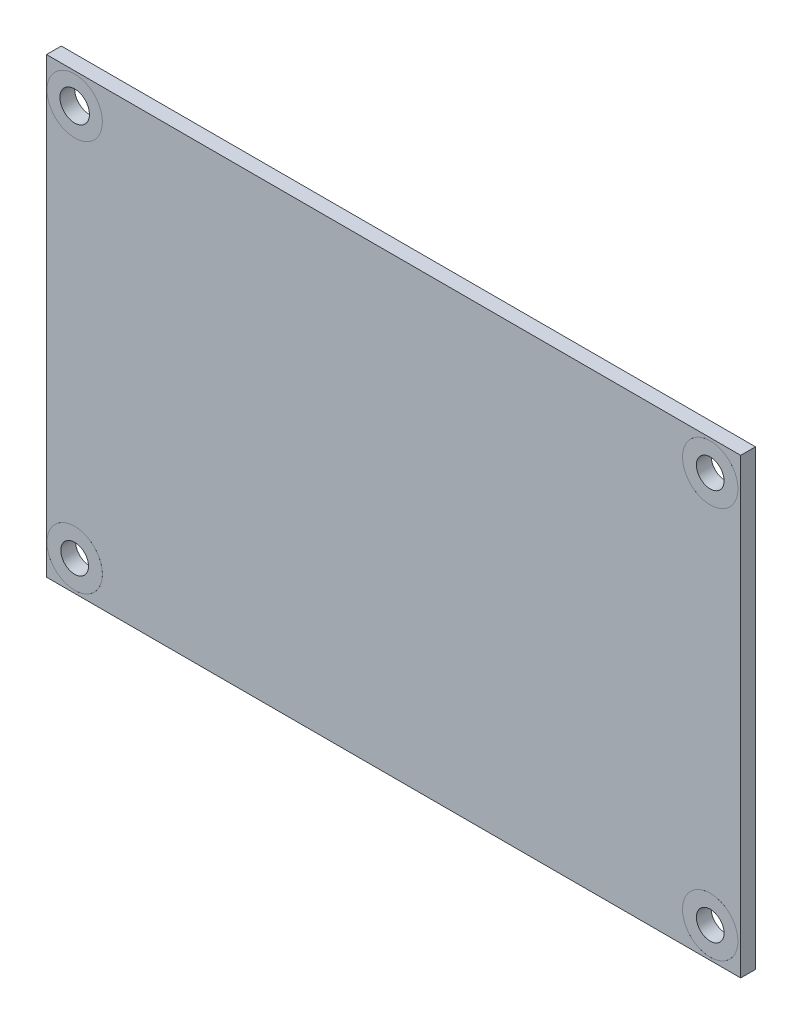
ISO-10303-21;
HEADER;
FILE_DESCRIPTION(('STEP AP214'),'2;1');
FILE_NAME('part.step','',(''),(''),'','','');
FILE_SCHEMA(('AUTOMOTIVE_DESIGN { 1 0 10303 214 1 1 1 1 }'));
ENDSEC;
DATA;
#1=APPLICATION_CONTEXT('core data for automotive mechanical design processes');
#2=APPLICATION_PROTOCOL_DEFINITION('international standard','automotive_design',2000,#1);
#3=PRODUCT_CONTEXT('',#1,'mechanical');
#4=PRODUCT('Part','Part','',(#3));
#5=PRODUCT_RELATED_PRODUCT_CATEGORY('part','',(#4));
#6=PRODUCT_DEFINITION_FORMATION('','',#4);
#7=PRODUCT_DEFINITION_CONTEXT('part definition',#1,'design');
#8=PRODUCT_DEFINITION('design','',#6,#7);
#9=PRODUCT_DEFINITION_SHAPE('','',#8);
#10=(LENGTH_UNIT() NAMED_UNIT(*) SI_UNIT(.MILLI.,.METRE.));
#11=(NAMED_UNIT(*) PLANE_ANGLE_UNIT() SI_UNIT($,.RADIAN.));
#12=(NAMED_UNIT(*) SI_UNIT($,.STERADIAN.) SOLID_ANGLE_UNIT());
#13=UNCERTAINTY_MEASURE_WITH_UNIT(LENGTH_MEASURE(1.E-05),#10,'distance_accuracy_value','');
#14=(GEOMETRIC_REPRESENTATION_CONTEXT(3) GLOBAL_UNCERTAINTY_ASSIGNED_CONTEXT((#13)) GLOBAL_UNIT_ASSIGNED_CONTEXT((#10,
#11,#12)) REPRESENTATION_CONTEXT('',''));
#15=CARTESIAN_POINT('',(0.,0.,0.));
#16=DIRECTION('',(0.,0.,1.));
#17=DIRECTION('',(1.,0.,0.));
#18=AXIS2_PLACEMENT_3D('',#15,#16,#17);
#19=CARTESIAN_POINT('',(-34.54,-21.21,10.0854813742386));
#20=DIRECTION('',(0.,0.,-1.));
#21=DIRECTION('',(-1.,0.,0.));
#22=AXIS2_PLACEMENT_3D('',#19,#20,#21);
#23=CYLINDRICAL_SURFACE('',#22,3.);
#24=CARTESIAN_POINT('',(-34.54,-21.21,0.));
#25=DIRECTION('',(0.,0.,-1.));
#26=DIRECTION('',(-1.,0.,0.));
#27=AXIS2_PLACEMENT_3D('',#24,#25,#26);
#28=CIRCLE('',#27,3.);
#29=CARTESIAN_POINT('',(-37.54,-21.21,0.));
#30=VERTEX_POINT('',#29);
#31=EDGE_CURVE('E47',#30,#30,#28,.T.);
#32=ORIENTED_EDGE('',*,*,#31,.F.);
#33=EDGE_LOOP('',(#32));
#34=FACE_BOUND('',#33,.T.);
#35=CARTESIAN_POINT('',(-34.54,-21.21,1.6002));
#36=DIRECTION('',(0.,0.,1.));
#37=DIRECTION('',(1.,0.,0.));
#38=AXIS2_PLACEMENT_3D('',#35,#36,#37);
#39=CIRCLE('',#38,3.);
#40=CARTESIAN_POINT('',(-31.54,-21.21,1.6002));
#41=VERTEX_POINT('',#40);
#42=EDGE_CURVE('E43',#41,#41,#39,.F.);
#43=ORIENTED_EDGE('',*,*,#42,.T.);
#44=EDGE_LOOP('',(#43));
#45=FACE_BOUND('',#44,.T.);
#46=ADVANCED_FACE('F39',(#34,#45),#23,.T.);
#47=CARTESIAN_POINT('',(-34.54,-21.21,10.0854813742386));
#48=DIRECTION('',(0.,0.,-1.));
#49=DIRECTION('',(-1.,0.,0.));
#50=AXIS2_PLACEMENT_3D('',#47,#48,#49);
#51=CYLINDRICAL_SURFACE('',#50,1.5);
#52=CARTESIAN_POINT('',(-34.54,-21.21,0.));
#53=DIRECTION('',(0.,0.,-1.));
#54=DIRECTION('',(-1.,0.,0.));
#55=AXIS2_PLACEMENT_3D('',#52,#53,#54);
#56=CIRCLE('',#55,1.5);
#57=CARTESIAN_POINT('',(-36.04,-21.21,0.));
#58=VERTEX_POINT('',#57);
#59=EDGE_CURVE('E51',#58,#58,#56,.T.);
#60=ORIENTED_EDGE('',*,*,#59,.T.);
#61=EDGE_LOOP('',(#60));
#62=FACE_BOUND('',#61,.T.);
#63=CARTESIAN_POINT('',(-34.54,-21.21,1.6002));
#64=DIRECTION('',(0.,0.,1.));
#65=DIRECTION('',(1.,0.,0.));
#66=AXIS2_PLACEMENT_3D('',#63,#64,#65);
#67=CIRCLE('',#66,1.5);
#68=CARTESIAN_POINT('',(-33.04,-21.21,1.6002));
#69=VERTEX_POINT('',#68);
#70=EDGE_CURVE('E11',#69,#69,#67,.F.);
#71=ORIENTED_EDGE('',*,*,#70,.F.);
#72=EDGE_LOOP('',(#71));
#73=FACE_BOUND('',#72,.T.);
#74=ADVANCED_FACE('F66',(#62,#73),#51,.F.);
#75=CARTESIAN_POINT('',(-34.54,-21.21,0.));
#76=DIRECTION('',(0.,0.,-1.));
#77=DIRECTION('',(-1.,0.,0.));
#78=AXIS2_PLACEMENT_3D('',#75,#76,#77);
#79=PLANE('',#78);
#80=ORIENTED_EDGE('',*,*,#59,.F.);
#81=EDGE_LOOP('',(#80));
#82=FACE_BOUND('',#81,.T.);
#83=ORIENTED_EDGE('',*,*,#31,.T.);
#84=EDGE_LOOP('',(#83));
#85=FACE_BOUND('',#84,.T.);
#86=ADVANCED_FACE('F62',(#82,#85),#79,.T.);
#87=CARTESIAN_POINT('',(0.,0.,1.6002));
#88=DIRECTION('',(0.,0.,1.));
#89=DIRECTION('',(1.,0.,0.));
#90=AXIS2_PLACEMENT_3D('',#87,#88,#89);
#91=PLANE('',#90);
#92=ORIENTED_EDGE('',*,*,#42,.F.);
#93=EDGE_LOOP('',(#92));
#94=FACE_BOUND('',#93,.T.);
#95=ORIENTED_EDGE('',*,*,#70,.T.);
#96=EDGE_LOOP('',(#95));
#97=FACE_BOUND('',#96,.T.);
#98=ADVANCED_FACE('F41',(#94,#97),#91,.T.);
#99=CLOSED_SHELL('',(#46,#74,#86,#98));
#100=MANIFOLD_SOLID_BREP('B2',#99);
#101=CARTESIAN_POINT('',(34.29,-21.21,10.0854813742386));
#102=DIRECTION('',(0.,0.,-1.));
#103=DIRECTION('',(-1.,0.,0.));
#104=AXIS2_PLACEMENT_3D('',#101,#102,#103);
#105=CYLINDRICAL_SURFACE('',#104,3.);
#106=CARTESIAN_POINT('',(34.29,-21.21,0.));
#107=DIRECTION('',(0.,0.,-1.));
#108=DIRECTION('',(-1.,0.,0.));
#109=AXIS2_PLACEMENT_3D('',#106,#107,#108);
#110=CIRCLE('',#109,3.);
#111=CARTESIAN_POINT('',(31.29,-21.21,0.));
#112=VERTEX_POINT('',#111);
#113=EDGE_CURVE('E116',#112,#112,#110,.T.);
#114=ORIENTED_EDGE('',*,*,#113,.F.);
#115=EDGE_LOOP('',(#114));
#116=FACE_BOUND('',#115,.T.);
#117=CARTESIAN_POINT('',(34.29,-21.21,1.6002));
#118=DIRECTION('',(0.,0.,1.));
#119=DIRECTION('',(1.,0.,0.));
#120=AXIS2_PLACEMENT_3D('',#117,#118,#119);
#121=CIRCLE('',#120,3.);
#122=CARTESIAN_POINT('',(37.29,-21.21,1.6002));
#123=VERTEX_POINT('',#122);
#124=EDGE_CURVE('E112',#123,#123,#121,.F.);
#125=ORIENTED_EDGE('',*,*,#124,.T.);
#126=EDGE_LOOP('',(#125));
#127=FACE_BOUND('',#126,.T.);
#128=ADVANCED_FACE('F108',(#116,#127),#105,.T.);
#129=CARTESIAN_POINT('',(34.29,-21.21,10.0854813742386));
#130=DIRECTION('',(0.,0.,-1.));
#131=DIRECTION('',(-1.,0.,0.));
#132=AXIS2_PLACEMENT_3D('',#129,#130,#131);
#133=CYLINDRICAL_SURFACE('',#132,1.5);
#134=CARTESIAN_POINT('',(34.29,-21.21,0.));
#135=DIRECTION('',(0.,0.,-1.));
#136=DIRECTION('',(-1.,0.,0.));
#137=AXIS2_PLACEMENT_3D('',#134,#135,#136);
#138=CIRCLE('',#137,1.5);
#139=CARTESIAN_POINT('',(32.79,-21.21,0.));
#140=VERTEX_POINT('',#139);
#141=EDGE_CURVE('E120',#140,#140,#138,.T.);
#142=ORIENTED_EDGE('',*,*,#141,.T.);
#143=EDGE_LOOP('',(#142));
#144=FACE_BOUND('',#143,.T.);
#145=CARTESIAN_POINT('',(34.29,-21.21,1.6002));
#146=DIRECTION('',(0.,0.,1.));
#147=DIRECTION('',(1.,0.,0.));
#148=AXIS2_PLACEMENT_3D('',#145,#146,#147);
#149=CIRCLE('',#148,1.5);
#150=CARTESIAN_POINT('',(35.79,-21.21,1.6002));
#151=VERTEX_POINT('',#150);
#152=EDGE_CURVE('E38',#151,#151,#149,.F.);
#153=ORIENTED_EDGE('',*,*,#152,.F.);
#154=EDGE_LOOP('',(#153));
#155=FACE_BOUND('',#154,.T.);
#156=ADVANCED_FACE('F135',(#144,#155),#133,.F.);
#157=CARTESIAN_POINT('',(34.29,-21.21,0.));
#158=DIRECTION('',(0.,0.,-1.));
#159=DIRECTION('',(-1.,0.,0.));
#160=AXIS2_PLACEMENT_3D('',#157,#158,#159);
#161=PLANE('',#160);
#162=ORIENTED_EDGE('',*,*,#141,.F.);
#163=EDGE_LOOP('',(#162));
#164=FACE_BOUND('',#163,.T.);
#165=ORIENTED_EDGE('',*,*,#113,.T.);
#166=EDGE_LOOP('',(#165));
#167=FACE_BOUND('',#166,.T.);
#168=ADVANCED_FACE('F131',(#164,#167),#161,.T.);
#169=CARTESIAN_POINT('',(0.,0.,1.6002));
#170=DIRECTION('',(0.,0.,1.));
#171=DIRECTION('',(1.,0.,0.));
#172=AXIS2_PLACEMENT_3D('',#169,#170,#171);
#173=PLANE('',#172);
#174=ORIENTED_EDGE('',*,*,#124,.F.);
#175=EDGE_LOOP('',(#174));
#176=FACE_BOUND('',#175,.T.);
#177=ORIENTED_EDGE('',*,*,#152,.T.);
#178=EDGE_LOOP('',(#177));
#179=FACE_BOUND('',#178,.T.);
#180=ADVANCED_FACE('F110',(#176,#179),#173,.T.);
#181=CLOSED_SHELL('',(#128,#156,#168,#180));
#182=MANIFOLD_SOLID_BREP('B6',#181);
#183=CARTESIAN_POINT('',(34.29,21.21,10.0854813742386));
#184=DIRECTION('',(0.,0.,-1.));
#185=DIRECTION('',(-1.,0.,0.));
#186=AXIS2_PLACEMENT_3D('',#183,#184,#185);
#187=CYLINDRICAL_SURFACE('',#186,3.00000000000001);
#188=CARTESIAN_POINT('',(34.29,21.21,0.));
#189=DIRECTION('',(0.,0.,-1.));
#190=DIRECTION('',(-1.,0.,0.));
#191=AXIS2_PLACEMENT_3D('',#188,#189,#190);
#192=CIRCLE('',#191,3.00000000000001);
#193=CARTESIAN_POINT('',(31.29,21.21,0.));
#194=VERTEX_POINT('',#193);
#195=EDGE_CURVE('E185',#194,#194,#192,.T.);
#196=ORIENTED_EDGE('',*,*,#195,.F.);
#197=EDGE_LOOP('',(#196));
#198=FACE_BOUND('',#197,.T.);
#199=CARTESIAN_POINT('',(34.29,21.21,1.6002));
#200=DIRECTION('',(0.,0.,1.));
#201=DIRECTION('',(1.,0.,0.));
#202=AXIS2_PLACEMENT_3D('',#199,#200,#201);
#203=CIRCLE('',#202,3.00000000000001);
#204=CARTESIAN_POINT('',(37.29,21.21,1.6002));
#205=VERTEX_POINT('',#204);
#206=EDGE_CURVE('E181',#205,#205,#203,.F.);
#207=ORIENTED_EDGE('',*,*,#206,.T.);
#208=EDGE_LOOP('',(#207));
#209=FACE_BOUND('',#208,.T.);
#210=ADVANCED_FACE('F177',(#198,#209),#187,.T.);
#211=CARTESIAN_POINT('',(34.29,21.21,10.0854813742386));
#212=DIRECTION('',(0.,0.,-1.));
#213=DIRECTION('',(-1.,0.,0.));
#214=AXIS2_PLACEMENT_3D('',#211,#212,#213);
#215=CYLINDRICAL_SURFACE('',#214,1.5);
#216=CARTESIAN_POINT('',(34.29,21.21,0.));
#217=DIRECTION('',(0.,0.,-1.));
#218=DIRECTION('',(-1.,0.,0.));
#219=AXIS2_PLACEMENT_3D('',#216,#217,#218);
#220=CIRCLE('',#219,1.5);
#221=CARTESIAN_POINT('',(32.79,21.21,0.));
#222=VERTEX_POINT('',#221);
#223=EDGE_CURVE('E189',#222,#222,#220,.T.);
#224=ORIENTED_EDGE('',*,*,#223,.T.);
#225=EDGE_LOOP('',(#224));
#226=FACE_BOUND('',#225,.T.);
#227=CARTESIAN_POINT('',(34.29,21.21,1.6002));
#228=DIRECTION('',(0.,0.,1.));
#229=DIRECTION('',(1.,0.,0.));
#230=AXIS2_PLACEMENT_3D('',#227,#228,#229);
#231=CIRCLE('',#230,1.5);
#232=CARTESIAN_POINT('',(35.79,21.21,1.6002));
#233=VERTEX_POINT('',#232);
#234=EDGE_CURVE('E107',#233,#233,#231,.F.);
#235=ORIENTED_EDGE('',*,*,#234,.F.);
#236=EDGE_LOOP('',(#235));
#237=FACE_BOUND('',#236,.T.);
#238=ADVANCED_FACE('F204',(#226,#237),#215,.F.);
#239=CARTESIAN_POINT('',(34.29,21.21,0.));
#240=DIRECTION('',(0.,0.,-1.));
#241=DIRECTION('',(-1.,0.,0.));
#242=AXIS2_PLACEMENT_3D('',#239,#240,#241);
#243=PLANE('',#242);
#244=ORIENTED_EDGE('',*,*,#223,.F.);
#245=EDGE_LOOP('',(#244));
#246=FACE_BOUND('',#245,.T.);
#247=ORIENTED_EDGE('',*,*,#195,.T.);
#248=EDGE_LOOP('',(#247));
#249=FACE_BOUND('',#248,.T.);
#250=ADVANCED_FACE('F200',(#246,#249),#243,.T.);
#251=CARTESIAN_POINT('',(0.,0.,1.6002));
#252=DIRECTION('',(0.,0.,1.));
#253=DIRECTION('',(1.,0.,0.));
#254=AXIS2_PLACEMENT_3D('',#251,#252,#253);
#255=PLANE('',#254);
#256=ORIENTED_EDGE('',*,*,#206,.F.);
#257=EDGE_LOOP('',(#256));
#258=FACE_BOUND('',#257,.T.);
#259=ORIENTED_EDGE('',*,*,#234,.T.);
#260=EDGE_LOOP('',(#259));
#261=FACE_BOUND('',#260,.T.);
#262=ADVANCED_FACE('F179',(#258,#261),#255,.T.);
#263=CLOSED_SHELL('',(#210,#238,#250,#262));
#264=MANIFOLD_SOLID_BREP('B33',#263);
#265=CARTESIAN_POINT('',(-34.54,21.21,-8.48528137423858));
#266=DIRECTION('',(0.,0.,1.));
#267=DIRECTION('',(1.,0.,0.));
#268=AXIS2_PLACEMENT_3D('',#265,#266,#267);
#269=CYLINDRICAL_SURFACE('',#268,3.);
#270=CARTESIAN_POINT('',(-34.54,21.21,0.));
#271=DIRECTION('',(0.,0.,1.));
#272=DIRECTION('',(1.,0.,0.));
#273=AXIS2_PLACEMENT_3D('',#270,#271,#272);
#274=CIRCLE('',#273,3.);
#275=CARTESIAN_POINT('',(-31.54,21.21,0.));
#276=VERTEX_POINT('',#275);
#277=EDGE_CURVE('E254',#276,#276,#274,.F.);
#278=ORIENTED_EDGE('',*,*,#277,.F.);
#279=EDGE_LOOP('',(#278));
#280=FACE_BOUND('',#279,.T.);
#281=CARTESIAN_POINT('',(-34.54,21.21,1.6002));
#282=DIRECTION('',(0.,0.,1.));
#283=DIRECTION('',(1.,0.,0.));
#284=AXIS2_PLACEMENT_3D('',#281,#282,#283);
#285=CIRCLE('',#284,3.);
#286=CARTESIAN_POINT('',(-31.54,21.21,1.6002));
#287=VERTEX_POINT('',#286);
#288=EDGE_CURVE('E258',#287,#287,#285,.T.);
#289=ORIENTED_EDGE('',*,*,#288,.F.);
#290=EDGE_LOOP('',(#289));
#291=FACE_BOUND('',#290,.T.);
#292=ADVANCED_FACE('F248',(#280,#291),#269,.T.);
#293=CARTESIAN_POINT('',(-34.54,21.21,1.6002));
#294=DIRECTION('',(0.,0.,1.));
#295=DIRECTION('',(1.,0.,0.));
#296=AXIS2_PLACEMENT_3D('',#293,#294,#295);
#297=PLANE('',#296);
#298=CARTESIAN_POINT('',(-34.54,21.21,1.6002));
#299=DIRECTION('',(0.,0.,1.));
#300=DIRECTION('',(1.,0.,0.));
#301=AXIS2_PLACEMENT_3D('',#298,#299,#300);
#302=CIRCLE('',#301,1.6);
#303=CARTESIAN_POINT('',(-32.94,21.21,1.6002));
#304=VERTEX_POINT('',#303);
#305=EDGE_CURVE('E263',#304,#304,#302,.T.);
#306=ORIENTED_EDGE('',*,*,#305,.F.);
#307=EDGE_LOOP('',(#306));
#308=FACE_BOUND('',#307,.T.);
#309=ORIENTED_EDGE('',*,*,#288,.T.);
#310=EDGE_LOOP('',(#309));
#311=FACE_BOUND('',#310,.T.);
#312=ADVANCED_FACE('F270',(#308,#311),#297,.T.);
#313=CARTESIAN_POINT('',(-34.54,21.21,-8.48528137423858));
#314=DIRECTION('',(0.,0.,1.));
#315=DIRECTION('',(1.,0.,0.));
#316=AXIS2_PLACEMENT_3D('',#313,#314,#315);
#317=CYLINDRICAL_SURFACE('',#316,1.6);
#318=CARTESIAN_POINT('',(-34.54,21.21,0.));
#319=DIRECTION('',(0.,0.,1.));
#320=DIRECTION('',(1.,0.,0.));
#321=AXIS2_PLACEMENT_3D('',#318,#319,#320);
#322=CIRCLE('',#321,1.6);
#323=CARTESIAN_POINT('',(-32.94,21.21,0.));
#324=VERTEX_POINT('',#323);
#325=EDGE_CURVE('E176',#324,#324,#322,.F.);
#326=ORIENTED_EDGE('',*,*,#325,.T.);
#327=EDGE_LOOP('',(#326));
#328=FACE_BOUND('',#327,.T.);
#329=ORIENTED_EDGE('',*,*,#305,.T.);
#330=EDGE_LOOP('',(#329));
#331=FACE_BOUND('',#330,.T.);
#332=ADVANCED_FACE('F268',(#328,#331),#317,.F.);
#333=CARTESIAN_POINT('',(0.,0.,0.));
#334=DIRECTION('',(0.,0.,1.));
#335=DIRECTION('',(1.,0.,0.));
#336=AXIS2_PLACEMENT_3D('',#333,#334,#335);
#337=PLANE('',#336);
#338=ORIENTED_EDGE('',*,*,#277,.T.);
#339=EDGE_LOOP('',(#338));
#340=FACE_BOUND('',#339,.T.);
#341=ORIENTED_EDGE('',*,*,#325,.F.);
#342=EDGE_LOOP('',(#341));
#343=FACE_BOUND('',#342,.T.);
#344=ADVANCED_FACE('F289',(#340,#343),#337,.F.);
#345=CLOSED_SHELL('',(#292,#312,#332,#344));
#346=MANIFOLD_SOLID_BREP('B102',#345);
#347=CARTESIAN_POINT('',(0.,0.,0.));
#348=DIRECTION('',(0.,0.,1.));
#349=DIRECTION('',(1.,0.,0.));
#350=AXIS2_PLACEMENT_3D('',#347,#348,#349);
#351=PLANE('',#350);
#352=CARTESIAN_POINT('',(-34.54,-21.21,0.));
#353=DIRECTION('',(0.,0.,-1.));
#354=DIRECTION('',(-1.,0.,0.));
#355=AXIS2_PLACEMENT_3D('',#352,#353,#354);
#356=CIRCLE('',#355,3.);
#357=CARTESIAN_POINT('',(-37.54,-21.21,0.));
#358=VERTEX_POINT('',#357);
#359=EDGE_CURVE('E412',#358,#358,#356,.T.);
#360=ORIENTED_EDGE('',*,*,#359,.F.);
#361=EDGE_LOOP('',(#360));
#362=FACE_BOUND('',#361,.T.);
#363=CARTESIAN_POINT('',(34.29,-21.21,0.));
#364=DIRECTION('',(0.,0.,-1.));
#365=DIRECTION('',(-1.,0.,0.));
#366=AXIS2_PLACEMENT_3D('',#363,#364,#365);
#367=CIRCLE('',#366,3.);
#368=CARTESIAN_POINT('',(31.29,-21.21,0.));
#369=VERTEX_POINT('',#368);
#370=EDGE_CURVE('E406',#369,#369,#367,.T.);
#371=ORIENTED_EDGE('',*,*,#370,.F.);
#372=EDGE_LOOP('',(#371));
#373=FACE_BOUND('',#372,.T.);
#374=CARTESIAN_POINT('',(34.29,21.21,0.));
#375=DIRECTION('',(0.,0.,-1.));
#376=DIRECTION('',(-1.,0.,0.));
#377=AXIS2_PLACEMENT_3D('',#374,#375,#376);
#378=CIRCLE('',#377,3.);
#379=CARTESIAN_POINT('',(31.29,21.21,0.));
#380=VERTEX_POINT('',#379);
#381=EDGE_CURVE('E400',#380,#380,#378,.T.);
#382=ORIENTED_EDGE('',*,*,#381,.F.);
#383=EDGE_LOOP('',(#382));
#384=FACE_BOUND('',#383,.T.);
#385=CARTESIAN_POINT('',(-34.54,21.21,0.));
#386=DIRECTION('',(0.,0.,1.));
#387=DIRECTION('',(1.,0.,0.));
#388=AXIS2_PLACEMENT_3D('',#385,#386,#387);
#389=CIRCLE('',#388,3.);
#390=CARTESIAN_POINT('',(-31.54,21.21,0.));
#391=VERTEX_POINT('',#390);
#392=EDGE_CURVE('E364',#391,#391,#389,.T.);
#393=ORIENTED_EDGE('',*,*,#392,.T.);
#394=EDGE_LOOP('',(#393));
#395=FACE_BOUND('',#394,.T.);
#396=DIRECTION('',(1.,0.,0.));
#397=VECTOR('',#396,1.);
#398=CARTESIAN_POINT('',(-37.59,-24.51,0.));
#399=LINE('',#398,#397);
#400=CARTESIAN_POINT('',(-37.59,-24.51,0.));
#401=VERTEX_POINT('',#400);
#402=CARTESIAN_POINT('',(37.59,-24.51,0.));
#403=VERTEX_POINT('',#402);
#404=EDGE_CURVE('E374',#401,#403,#399,.T.);
#405=ORIENTED_EDGE('',*,*,#404,.F.);
#406=DIRECTION('',(0.,1.,0.));
#407=VECTOR('',#406,1.);
#408=CARTESIAN_POINT('',(-37.59,24.51,0.));
#409=LINE('',#408,#407);
#410=CARTESIAN_POINT('',(-37.59,24.51,0.));
#411=VERTEX_POINT('',#410);
#412=EDGE_CURVE('E349',#411,#401,#409,.F.);
#413=ORIENTED_EDGE('',*,*,#412,.F.);
#414=DIRECTION('',(1.,0.,0.));
#415=VECTOR('',#414,1.);
#416=CARTESIAN_POINT('',(37.59,24.51,0.));
#417=LINE('',#416,#415);
#418=CARTESIAN_POINT('',(37.59,24.51,0.));
#419=VERTEX_POINT('',#418);
#420=EDGE_CURVE('E351',#419,#411,#417,.F.);
#421=ORIENTED_EDGE('',*,*,#420,.F.);
#422=DIRECTION('',(0.,1.,0.));
#423=VECTOR('',#422,1.);
#424=CARTESIAN_POINT('',(37.59,-24.51,0.));
#425=LINE('',#424,#423);
#426=EDGE_CURVE('E314',#403,#419,#425,.T.);
#427=ORIENTED_EDGE('',*,*,#426,.F.);
#428=EDGE_LOOP('',(#405,#413,#421,#427));
#429=FACE_BOUND('',#428,.T.);
#430=ADVANCED_FACE('F311',(#362,#373,#384,#395,#429),#351,.F.);
#431=CARTESIAN_POINT('',(37.59,-24.51,0.));
#432=DIRECTION('',(1.,0.,0.));
#433=DIRECTION('',(0.,0.,-1.));
#434=AXIS2_PLACEMENT_3D('',#431,#432,#433);
#435=PLANE('',#434);
#436=DIRECTION('',(0.,1.,0.));
#437=VECTOR('',#436,1.);
#438=CARTESIAN_POINT('',(37.59,0.,1.6002));
#439=LINE('',#438,#437);
#440=CARTESIAN_POINT('',(37.59,-24.51,1.6002));
#441=VERTEX_POINT('',#440);
#442=CARTESIAN_POINT('',(37.59,24.51,1.6002));
#443=VERTEX_POINT('',#442);
#444=EDGE_CURVE('E383',#441,#443,#439,.T.);
#445=ORIENTED_EDGE('',*,*,#444,.F.);
#446=DIRECTION('',(0.,0.,-1.));
#447=VECTOR('',#446,1.);
#448=CARTESIAN_POINT('',(37.59,-24.51,0.));
#449=LINE('',#448,#447);
#450=EDGE_CURVE('E362',#403,#441,#449,.F.);
#451=ORIENTED_EDGE('',*,*,#450,.F.);
#452=ORIENTED_EDGE('',*,*,#426,.T.);
#453=DIRECTION('',(0.,0.,1.));
#454=VECTOR('',#453,1.);
#455=CARTESIAN_POINT('',(37.59,24.51,0.));
#456=LINE('',#455,#454);
#457=EDGE_CURVE('E357',#443,#419,#456,.F.);
#458=ORIENTED_EDGE('',*,*,#457,.F.);
#459=EDGE_LOOP('',(#445,#451,#452,#458));
#460=FACE_BOUND('',#459,.T.);
#461=ADVANCED_FACE('F359',(#460),#435,.T.);
#462=CARTESIAN_POINT('',(37.59,24.51,0.));
#463=DIRECTION('',(0.,1.,0.));
#464=DIRECTION('',(0.,0.,1.));
#465=AXIS2_PLACEMENT_3D('',#462,#463,#464);
#466=PLANE('',#465);
#467=DIRECTION('',(1.,0.,0.));
#468=VECTOR('',#467,1.);
#469=CARTESIAN_POINT('',(0.,24.51,1.6002));
#470=LINE('',#469,#468);
#471=CARTESIAN_POINT('',(-37.59,24.51,1.6002));
#472=VERTEX_POINT('',#471);
#473=EDGE_CURVE('E367',#443,#472,#470,.F.);
#474=ORIENTED_EDGE('',*,*,#473,.F.);
#475=ORIENTED_EDGE('',*,*,#457,.T.);
#476=ORIENTED_EDGE('',*,*,#420,.T.);
#477=DIRECTION('',(0.,0.,1.));
#478=VECTOR('',#477,1.);
#479=CARTESIAN_POINT('',(-37.59,24.51,0.));
#480=LINE('',#479,#478);
#481=EDGE_CURVE('E370',#472,#411,#480,.F.);
#482=ORIENTED_EDGE('',*,*,#481,.F.);
#483=EDGE_LOOP('',(#474,#475,#476,#482));
#484=FACE_BOUND('',#483,.T.);
#485=ADVANCED_FACE('F365',(#484),#466,.T.);
#486=CARTESIAN_POINT('',(-37.59,24.51,0.));
#487=DIRECTION('',(-1.,0.,0.));
#488=DIRECTION('',(0.,0.,1.));
#489=AXIS2_PLACEMENT_3D('',#486,#487,#488);
#490=PLANE('',#489);
#491=DIRECTION('',(0.,1.,0.));
#492=VECTOR('',#491,1.);
#493=CARTESIAN_POINT('',(-37.59,0.,1.6002));
#494=LINE('',#493,#492);
#495=CARTESIAN_POINT('',(-37.59,-24.51,1.6002));
#496=VERTEX_POINT('',#495);
#497=EDGE_CURVE('E320',#472,#496,#494,.F.);
#498=ORIENTED_EDGE('',*,*,#497,.F.);
#499=ORIENTED_EDGE('',*,*,#481,.T.);
#500=ORIENTED_EDGE('',*,*,#412,.T.);
#501=DIRECTION('',(0.,0.,-1.));
#502=VECTOR('',#501,1.);
#503=CARTESIAN_POINT('',(-37.59,-24.51,0.));
#504=LINE('',#503,#502);
#505=EDGE_CURVE('E329',#496,#401,#504,.T.);
#506=ORIENTED_EDGE('',*,*,#505,.F.);
#507=EDGE_LOOP('',(#498,#499,#500,#506));
#508=FACE_BOUND('',#507,.T.);
#509=ADVANCED_FACE('F447',(#508),#490,.T.);
#510=CARTESIAN_POINT('',(-37.59,-24.51,0.));
#511=DIRECTION('',(0.,-1.,0.));
#512=DIRECTION('',(0.,0.,-1.));
#513=AXIS2_PLACEMENT_3D('',#510,#511,#512);
#514=PLANE('',#513);
#515=DIRECTION('',(1.,0.,0.));
#516=VECTOR('',#515,1.);
#517=CARTESIAN_POINT('',(0.,-24.51,1.6002));
#518=LINE('',#517,#516);
#519=EDGE_CURVE('E246',#496,#441,#518,.T.);
#520=ORIENTED_EDGE('',*,*,#519,.F.);
#521=ORIENTED_EDGE('',*,*,#505,.T.);
#522=ORIENTED_EDGE('',*,*,#404,.T.);
#523=ORIENTED_EDGE('',*,*,#450,.T.);
#524=EDGE_LOOP('',(#520,#521,#522,#523));
#525=FACE_BOUND('',#524,.T.);
#526=ADVANCED_FACE('F388',(#525),#514,.T.);
#527=CARTESIAN_POINT('',(0.,0.,1.6002));
#528=DIRECTION('',(0.,0.,1.));
#529=DIRECTION('',(1.,0.,0.));
#530=AXIS2_PLACEMENT_3D('',#527,#528,#529);
#531=PLANE('',#530);
#532=CARTESIAN_POINT('',(-34.54,-21.21,1.6002));
#533=DIRECTION('',(0.,0.,-1.));
#534=DIRECTION('',(-1.,0.,0.));
#535=AXIS2_PLACEMENT_3D('',#532,#533,#534);
#536=CIRCLE('',#535,3.);
#537=CARTESIAN_POINT('',(-37.54,-21.21,1.6002));
#538=VERTEX_POINT('',#537);
#539=EDGE_CURVE('E397',#538,#538,#536,.T.);
#540=ORIENTED_EDGE('',*,*,#539,.T.);
#541=EDGE_LOOP('',(#540));
#542=FACE_BOUND('',#541,.T.);
#543=CARTESIAN_POINT('',(34.29,-21.21,1.6002));
#544=DIRECTION('',(0.,0.,-1.));
#545=DIRECTION('',(-1.,0.,0.));
#546=AXIS2_PLACEMENT_3D('',#543,#544,#545);
#547=CIRCLE('',#546,3.);
#548=CARTESIAN_POINT('',(31.29,-21.21,1.6002));
#549=VERTEX_POINT('',#548);
#550=EDGE_CURVE('E409',#549,#549,#547,.T.);
#551=ORIENTED_EDGE('',*,*,#550,.T.);
#552=EDGE_LOOP('',(#551));
#553=FACE_BOUND('',#552,.T.);
#554=CARTESIAN_POINT('',(34.29,21.21,1.6002));
#555=DIRECTION('',(0.,0.,-1.));
#556=DIRECTION('',(-1.,0.,0.));
#557=AXIS2_PLACEMENT_3D('',#554,#555,#556);
#558=CIRCLE('',#557,3.);
#559=CARTESIAN_POINT('',(31.29,21.21,1.6002));
#560=VERTEX_POINT('',#559);
#561=EDGE_CURVE('E403',#560,#560,#558,.T.);
#562=ORIENTED_EDGE('',*,*,#561,.T.);
#563=EDGE_LOOP('',(#562));
#564=FACE_BOUND('',#563,.T.);
#565=CARTESIAN_POINT('',(-34.54,21.21,1.6002));
#566=DIRECTION('',(0.,0.,1.));
#567=DIRECTION('',(1.,0.,0.));
#568=AXIS2_PLACEMENT_3D('',#565,#566,#567);
#569=CIRCLE('',#568,3.);
#570=CARTESIAN_POINT('',(-31.54,21.21,1.6002));
#571=VERTEX_POINT('',#570);
#572=EDGE_CURVE('E394',#571,#571,#569,.T.);
#573=ORIENTED_EDGE('',*,*,#572,.F.);
#574=EDGE_LOOP('',(#573));
#575=FACE_BOUND('',#574,.T.);
#576=ORIENTED_EDGE('',*,*,#497,.T.);
#577=ORIENTED_EDGE('',*,*,#519,.T.);
#578=ORIENTED_EDGE('',*,*,#444,.T.);
#579=ORIENTED_EDGE('',*,*,#473,.T.);
#580=EDGE_LOOP('',(#576,#577,#578,#579));
#581=FACE_BOUND('',#580,.T.);
#582=ADVANCED_FACE('F391',(#542,#553,#564,#575,#581),#531,.T.);
#583=CARTESIAN_POINT('',(-34.54,21.21,0.));
#584=DIRECTION('',(0.,0.,1.));
#585=DIRECTION('',(1.,0.,0.));
#586=AXIS2_PLACEMENT_3D('',#583,#584,#585);
#587=CYLINDRICAL_SURFACE('',#586,3.);
#588=ORIENTED_EDGE('',*,*,#392,.F.);
#589=EDGE_LOOP('',(#588));
#590=FACE_BOUND('',#589,.T.);
#591=ORIENTED_EDGE('',*,*,#572,.T.);
#592=EDGE_LOOP('',(#591));
#593=FACE_BOUND('',#592,.T.);
#594=ADVANCED_FACE('F429',(#590,#593),#587,.F.);
#595=CARTESIAN_POINT('',(34.29,21.21,1.6002));
#596=DIRECTION('',(0.,0.,-1.));
#597=DIRECTION('',(-1.,0.,0.));
#598=AXIS2_PLACEMENT_3D('',#595,#596,#597);
#599=CYLINDRICAL_SURFACE('',#598,3.);
#600=ORIENTED_EDGE('',*,*,#561,.F.);
#601=EDGE_LOOP('',(#600));
#602=FACE_BOUND('',#601,.T.);
#603=ORIENTED_EDGE('',*,*,#381,.T.);
#604=EDGE_LOOP('',(#603));
#605=FACE_BOUND('',#604,.T.);
#606=ADVANCED_FACE('F438',(#602,#605),#599,.F.);
#607=CARTESIAN_POINT('',(34.29,-21.21,1.6002));
#608=DIRECTION('',(0.,0.,-1.));
#609=DIRECTION('',(-1.,0.,0.));
#610=AXIS2_PLACEMENT_3D('',#607,#608,#609);
#611=CYLINDRICAL_SURFACE('',#610,3.);
#612=ORIENTED_EDGE('',*,*,#550,.F.);
#613=EDGE_LOOP('',(#612));
#614=FACE_BOUND('',#613,.T.);
#615=ORIENTED_EDGE('',*,*,#370,.T.);
#616=EDGE_LOOP('',(#615));
#617=FACE_BOUND('',#616,.T.);
#618=ADVANCED_FACE('F423',(#614,#617),#611,.F.);
#619=CARTESIAN_POINT('',(-34.54,-21.21,1.6002));
#620=DIRECTION('',(0.,0.,-1.));
#621=DIRECTION('',(-1.,0.,0.));
#622=AXIS2_PLACEMENT_3D('',#619,#620,#621);
#623=CYLINDRICAL_SURFACE('',#622,3.);
#624=ORIENTED_EDGE('',*,*,#539,.F.);
#625=EDGE_LOOP('',(#624));
#626=FACE_BOUND('',#625,.T.);
#627=ORIENTED_EDGE('',*,*,#359,.T.);
#628=EDGE_LOOP('',(#627));
#629=FACE_BOUND('',#628,.T.);
#630=ADVANCED_FACE('F420',(#626,#629),#623,.F.);
#631=CLOSED_SHELL('',(#430,#461,#485,#509,#526,#582,#594,#606,#618,#630));
#632=MANIFOLD_SOLID_BREP('B171',#631);
#633=ADVANCED_BREP_SHAPE_REPRESENTATION('',(#18,#100,#182,#264,#346,#632),#14);
#634=SHAPE_DEFINITION_REPRESENTATION(#9,#633);
ENDSEC;
END-ISO-10303-21;
